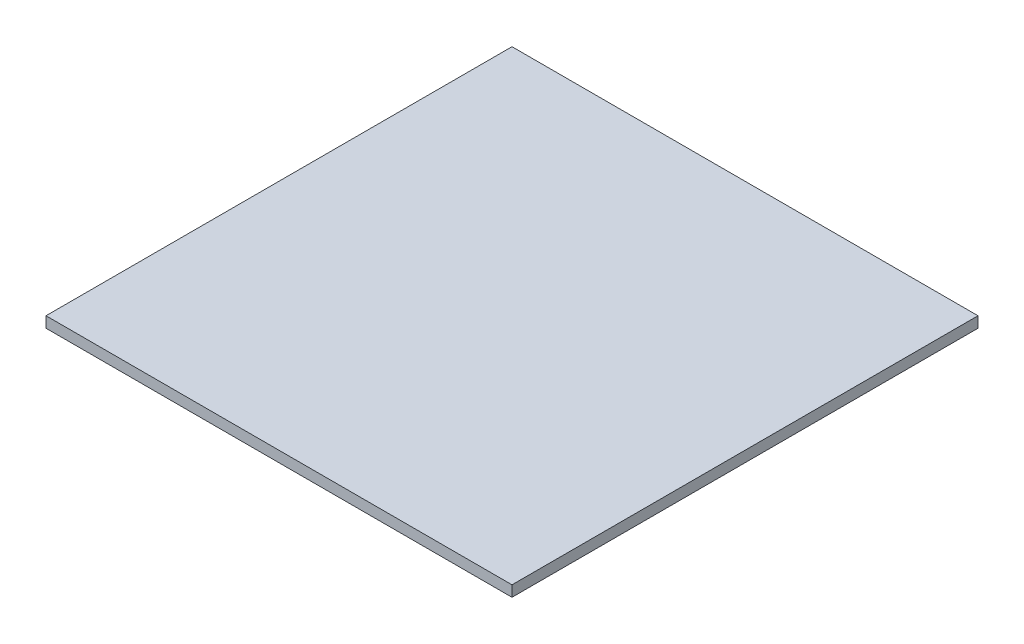
ISO-10303-21;
HEADER;
FILE_DESCRIPTION(('STEP AP214'),'2;1');
FILE_NAME('part.step','',(''),(''),'','','');
FILE_SCHEMA(('AUTOMOTIVE_DESIGN { 1 0 10303 214 1 1 1 1 }'));
ENDSEC;
DATA;
#1=APPLICATION_CONTEXT('core data for automotive mechanical design processes');
#2=APPLICATION_PROTOCOL_DEFINITION('international standard','automotive_design',2000,#1);
#3=PRODUCT_CONTEXT('',#1,'mechanical');
#4=PRODUCT('Part','Part','',(#3));
#5=PRODUCT_RELATED_PRODUCT_CATEGORY('part','',(#4));
#6=PRODUCT_DEFINITION_FORMATION('','',#4);
#7=PRODUCT_DEFINITION_CONTEXT('part definition',#1,'design');
#8=PRODUCT_DEFINITION('design','',#6,#7);
#9=PRODUCT_DEFINITION_SHAPE('','',#8);
#10=(LENGTH_UNIT() NAMED_UNIT(*) SI_UNIT(.MILLI.,.METRE.));
#11=(NAMED_UNIT(*) PLANE_ANGLE_UNIT() SI_UNIT($,.RADIAN.));
#12=(NAMED_UNIT(*) SI_UNIT($,.STERADIAN.) SOLID_ANGLE_UNIT());
#13=UNCERTAINTY_MEASURE_WITH_UNIT(LENGTH_MEASURE(1.E-05),#10,'distance_accuracy_value','');
#14=(GEOMETRIC_REPRESENTATION_CONTEXT(3) GLOBAL_UNCERTAINTY_ASSIGNED_CONTEXT((#13)) GLOBAL_UNIT_ASSIGNED_CONTEXT((#10,
#11,#12)) REPRESENTATION_CONTEXT('',''));
#15=CARTESIAN_POINT('',(0.,0.,0.));
#16=DIRECTION('',(0.,0.,1.));
#17=DIRECTION('',(1.,0.,0.));
#18=AXIS2_PLACEMENT_3D('',#15,#16,#17);
#19=CARTESIAN_POINT('',(215.,10.,215.));
#20=DIRECTION('',(-1.,0.,0.));
#21=DIRECTION('',(0.,0.,1.));
#22=AXIS2_PLACEMENT_3D('',#19,#20,#21);
#23=PLANE('',#22);
#24=DIRECTION('',(0.,0.,-1.));
#25=VECTOR('',#24,1.);
#26=CARTESIAN_POINT('',(215.,0.,215.));
#27=LINE('',#26,#25);
#28=CARTESIAN_POINT('',(215.,0.,215.));
#29=VERTEX_POINT('',#28);
#30=CARTESIAN_POINT('',(215.,0.,-215.));
#31=VERTEX_POINT('',#30);
#32=EDGE_CURVE('E96',#29,#31,#27,.T.);
#33=ORIENTED_EDGE('',*,*,#32,.T.);
#34=DIRECTION('',(0.,-1.,0.));
#35=VECTOR('',#34,1.);
#36=CARTESIAN_POINT('',(215.,10.,-215.));
#37=LINE('',#36,#35);
#38=CARTESIAN_POINT('',(215.,10.,-215.));
#39=VERTEX_POINT('',#38);
#40=EDGE_CURVE('E11',#39,#31,#37,.T.);
#41=ORIENTED_EDGE('',*,*,#40,.F.);
#42=DIRECTION('',(0.,0.,-1.));
#43=VECTOR('',#42,1.);
#44=CARTESIAN_POINT('',(215.,10.,215.));
#45=LINE('',#44,#43);
#46=CARTESIAN_POINT('',(215.,10.,215.));
#47=VERTEX_POINT('',#46);
#48=EDGE_CURVE('E84',#47,#39,#45,.T.);
#49=ORIENTED_EDGE('',*,*,#48,.F.);
#50=DIRECTION('',(0.,-1.,0.));
#51=VECTOR('',#50,1.);
#52=CARTESIAN_POINT('',(215.,10.,215.));
#53=LINE('',#52,#51);
#54=EDGE_CURVE('E92',#47,#29,#53,.T.);
#55=ORIENTED_EDGE('',*,*,#54,.T.);
#56=EDGE_LOOP('',(#33,#41,#49,#55));
#57=FACE_BOUND('',#56,.T.);
#58=ADVANCED_FACE('F33',(#57),#23,.F.);
#59=CARTESIAN_POINT('',(-215.,10.,-215.));
#60=DIRECTION('',(0.,0.,1.));
#61=DIRECTION('',(1.,0.,0.));
#62=AXIS2_PLACEMENT_3D('',#59,#60,#61);
#63=PLANE('',#62);
#64=DIRECTION('',(-1.,0.,0.));
#65=VECTOR('',#64,1.);
#66=CARTESIAN_POINT('',(-215.,0.,-215.));
#67=LINE('',#66,#65);
#68=CARTESIAN_POINT('',(-215.,0.,-215.));
#69=VERTEX_POINT('',#68);
#70=EDGE_CURVE('E88',#31,#69,#67,.T.);
#71=ORIENTED_EDGE('',*,*,#70,.T.);
#72=DIRECTION('',(0.,-1.,0.));
#73=VECTOR('',#72,1.);
#74=CARTESIAN_POINT('',(-215.,10.,-215.));
#75=LINE('',#74,#73);
#76=CARTESIAN_POINT('',(-215.,10.,-215.));
#77=VERTEX_POINT('',#76);
#78=EDGE_CURVE('E41',#77,#69,#75,.T.);
#79=ORIENTED_EDGE('',*,*,#78,.F.);
#80=DIRECTION('',(-1.,0.,0.));
#81=VECTOR('',#80,1.);
#82=CARTESIAN_POINT('',(-215.,10.,-215.));
#83=LINE('',#82,#81);
#84=EDGE_CURVE('E79',#39,#77,#83,.T.);
#85=ORIENTED_EDGE('',*,*,#84,.F.);
#86=ORIENTED_EDGE('',*,*,#40,.T.);
#87=EDGE_LOOP('',(#71,#79,#85,#86));
#88=FACE_BOUND('',#87,.T.);
#89=ADVANCED_FACE('F87',(#88),#63,.F.);
#90=CARTESIAN_POINT('',(-215.,10.,215.));
#91=DIRECTION('',(1.,0.,0.));
#92=DIRECTION('',(0.,0.,-1.));
#93=AXIS2_PLACEMENT_3D('',#90,#91,#92);
#94=PLANE('',#93);
#95=DIRECTION('',(0.,0.,1.));
#96=VECTOR('',#95,1.);
#97=CARTESIAN_POINT('',(-215.,0.,215.));
#98=LINE('',#97,#96);
#99=CARTESIAN_POINT('',(-215.,0.,215.));
#100=VERTEX_POINT('',#99);
#101=EDGE_CURVE('E66',#69,#100,#98,.T.);
#102=ORIENTED_EDGE('',*,*,#101,.T.);
#103=DIRECTION('',(0.,-1.,0.));
#104=VECTOR('',#103,1.);
#105=CARTESIAN_POINT('',(-215.,10.,215.));
#106=LINE('',#105,#104);
#107=CARTESIAN_POINT('',(-215.,10.,215.));
#108=VERTEX_POINT('',#107);
#109=EDGE_CURVE('E89',#108,#100,#106,.T.);
#110=ORIENTED_EDGE('',*,*,#109,.F.);
#111=DIRECTION('',(0.,0.,1.));
#112=VECTOR('',#111,1.);
#113=CARTESIAN_POINT('',(-215.,10.,215.));
#114=LINE('',#113,#112);
#115=EDGE_CURVE('E82',#77,#108,#114,.T.);
#116=ORIENTED_EDGE('',*,*,#115,.F.);
#117=ORIENTED_EDGE('',*,*,#78,.T.);
#118=EDGE_LOOP('',(#102,#110,#116,#117));
#119=FACE_BOUND('',#118,.T.);
#120=ADVANCED_FACE('F90',(#119),#94,.F.);
#121=CARTESIAN_POINT('',(-215.,10.,215.));
#122=DIRECTION('',(0.,0.,-1.));
#123=DIRECTION('',(-1.,0.,0.));
#124=AXIS2_PLACEMENT_3D('',#121,#122,#123);
#125=PLANE('',#124);
#126=DIRECTION('',(1.,0.,0.));
#127=VECTOR('',#126,1.);
#128=CARTESIAN_POINT('',(-215.,0.,215.));
#129=LINE('',#128,#127);
#130=EDGE_CURVE('E72',#100,#29,#129,.T.);
#131=ORIENTED_EDGE('',*,*,#130,.T.);
#132=ORIENTED_EDGE('',*,*,#54,.F.);
#133=DIRECTION('',(1.,0.,0.));
#134=VECTOR('',#133,1.);
#135=CARTESIAN_POINT('',(-215.,10.,215.));
#136=LINE('',#135,#134);
#137=EDGE_CURVE('E49',#108,#47,#136,.T.);
#138=ORIENTED_EDGE('',*,*,#137,.F.);
#139=ORIENTED_EDGE('',*,*,#109,.T.);
#140=EDGE_LOOP('',(#131,#132,#138,#139));
#141=FACE_BOUND('',#140,.T.);
#142=ADVANCED_FACE('F103',(#141),#125,.F.);
#143=CARTESIAN_POINT('',(0.,10.,0.));
#144=DIRECTION('',(0.,-1.,0.));
#145=DIRECTION('',(0.,0.,-1.));
#146=AXIS2_PLACEMENT_3D('',#143,#144,#145);
#147=PLANE('',#146);
#148=ORIENTED_EDGE('',*,*,#48,.T.);
#149=ORIENTED_EDGE('',*,*,#84,.T.);
#150=ORIENTED_EDGE('',*,*,#115,.T.);
#151=ORIENTED_EDGE('',*,*,#137,.T.);
#152=EDGE_LOOP('',(#148,#149,#150,#151));
#153=FACE_BOUND('',#152,.T.);
#154=ADVANCED_FACE('F80',(#153),#147,.F.);
#155=CARTESIAN_POINT('',(0.,0.,0.));
#156=DIRECTION('',(0.,-1.,0.));
#157=DIRECTION('',(0.,0.,-1.));
#158=AXIS2_PLACEMENT_3D('',#155,#156,#157);
#159=PLANE('',#158);
#160=ORIENTED_EDGE('',*,*,#32,.F.);
#161=ORIENTED_EDGE('',*,*,#130,.F.);
#162=ORIENTED_EDGE('',*,*,#101,.F.);
#163=ORIENTED_EDGE('',*,*,#70,.F.);
#164=EDGE_LOOP('',(#160,#161,#162,#163));
#165=FACE_BOUND('',#164,.T.);
#166=ADVANCED_FACE('F106',(#165),#159,.T.);
#167=CLOSED_SHELL('',(#58,#89,#120,#142,#154,#166));
#168=MANIFOLD_SOLID_BREP('B2',#167);
#169=ADVANCED_BREP_SHAPE_REPRESENTATION('',(#18,#168),#14);
#170=SHAPE_DEFINITION_REPRESENTATION(#9,#169);
ENDSEC;
END-ISO-10303-21;
